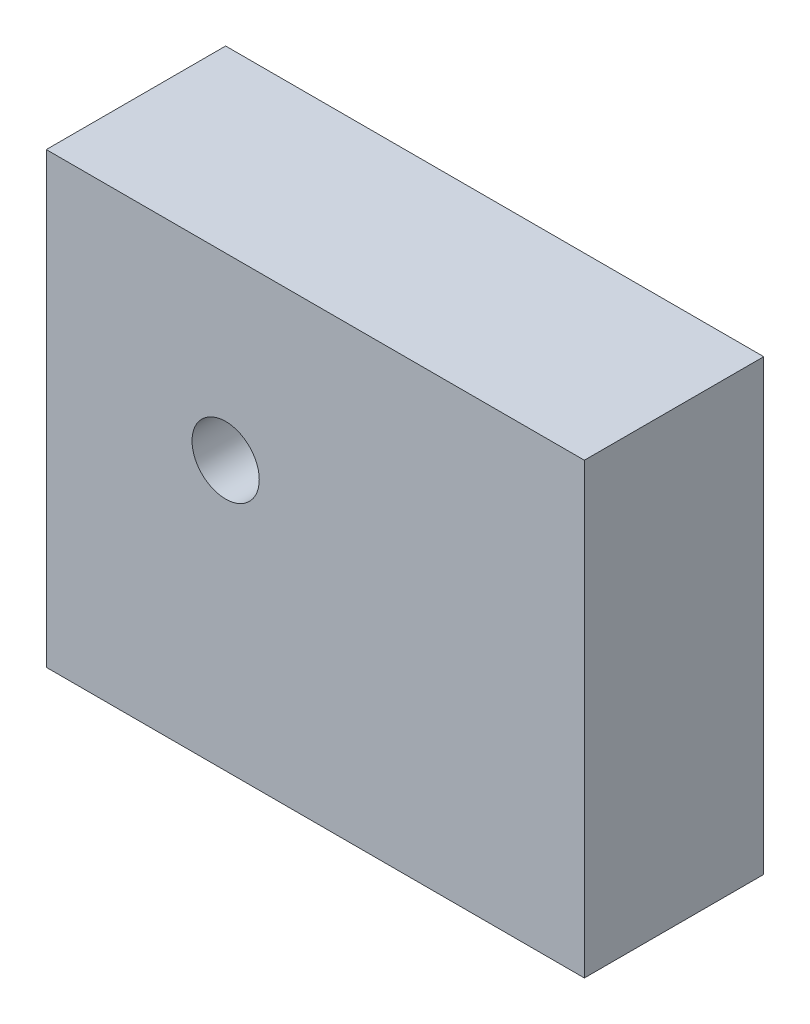
ISO-10303-21;
HEADER;
FILE_DESCRIPTION(('STEP AP214'),'2;1');
FILE_NAME('part.step','',(''),(''),'','','');
FILE_SCHEMA(('AUTOMOTIVE_DESIGN { 1 0 10303 214 1 1 1 1 }'));
ENDSEC;
DATA;
#1=APPLICATION_CONTEXT('core data for automotive mechanical design processes');
#2=APPLICATION_PROTOCOL_DEFINITION('international standard','automotive_design',2000,#1);
#3=PRODUCT_CONTEXT('',#1,'mechanical');
#4=PRODUCT('Part','Part','',(#3));
#5=PRODUCT_RELATED_PRODUCT_CATEGORY('part','',(#4));
#6=PRODUCT_DEFINITION_FORMATION('','',#4);
#7=PRODUCT_DEFINITION_CONTEXT('part definition',#1,'design');
#8=PRODUCT_DEFINITION('design','',#6,#7);
#9=PRODUCT_DEFINITION_SHAPE('','',#8);
#10=(LENGTH_UNIT() NAMED_UNIT(*) SI_UNIT(.MILLI.,.METRE.));
#11=(NAMED_UNIT(*) PLANE_ANGLE_UNIT() SI_UNIT($,.RADIAN.));
#12=(NAMED_UNIT(*) SI_UNIT($,.STERADIAN.) SOLID_ANGLE_UNIT());
#13=UNCERTAINTY_MEASURE_WITH_UNIT(LENGTH_MEASURE(1.E-05),#10,'distance_accuracy_value','');
#14=(GEOMETRIC_REPRESENTATION_CONTEXT(3) GLOBAL_UNCERTAINTY_ASSIGNED_CONTEXT((#13)) GLOBAL_UNIT_ASSIGNED_CONTEXT((#10,
#11,#12)) REPRESENTATION_CONTEXT('',''));
#15=CARTESIAN_POINT('',(0.,0.,0.));
#16=DIRECTION('',(0.,0.,1.));
#17=DIRECTION('',(1.,0.,0.));
#18=AXIS2_PLACEMENT_3D('',#15,#16,#17);
#19=CARTESIAN_POINT('',(0.,0.,25.4));
#20=DIRECTION('',(0.,0.,-1.));
#21=DIRECTION('',(-1.,0.,0.));
#22=AXIS2_PLACEMENT_3D('',#19,#20,#21);
#23=PLANE('',#22);
#24=DIRECTION('',(0.,-1.,0.));
#25=VECTOR('',#24,1.);
#26=CARTESIAN_POINT('',(0.,0.,25.4));
#27=LINE('',#26,#25);
#28=CARTESIAN_POINT('',(0.,63.5,25.4));
#29=VERTEX_POINT('',#28);
#30=CARTESIAN_POINT('',(0.,0.,25.4));
#31=VERTEX_POINT('',#30);
#32=EDGE_CURVE('E85',#29,#31,#27,.T.);
#33=ORIENTED_EDGE('',*,*,#32,.T.);
#34=DIRECTION('',(1.,0.,0.));
#35=VECTOR('',#34,1.);
#36=CARTESIAN_POINT('',(0.,0.,25.4));
#37=LINE('',#36,#35);
#38=CARTESIAN_POINT('',(76.2,0.,25.4));
#39=VERTEX_POINT('',#38);
#40=EDGE_CURVE('E80',#31,#39,#37,.T.);
#41=ORIENTED_EDGE('',*,*,#40,.T.);
#42=DIRECTION('',(0.,1.,0.));
#43=VECTOR('',#42,1.);
#44=CARTESIAN_POINT('',(76.2,0.,25.4));
#45=LINE('',#44,#43);
#46=CARTESIAN_POINT('',(76.2,63.5,25.4));
#47=VERTEX_POINT('',#46);
#48=EDGE_CURVE('E83',#39,#47,#45,.T.);
#49=ORIENTED_EDGE('',*,*,#48,.T.);
#50=DIRECTION('',(-1.,0.,0.));
#51=VECTOR('',#50,1.);
#52=CARTESIAN_POINT('',(0.,63.5,25.4));
#53=LINE('',#52,#51);
#54=EDGE_CURVE('E50',#47,#29,#53,.T.);
#55=ORIENTED_EDGE('',*,*,#54,.T.);
#56=EDGE_LOOP('',(#33,#41,#49,#55));
#57=FACE_BOUND('',#56,.T.);
#58=CARTESIAN_POINT('',(25.4,38.1,25.4));
#59=DIRECTION('',(0.,0.,1.));
#60=DIRECTION('',(1.,0.,0.));
#61=AXIS2_PLACEMENT_3D('',#58,#59,#60);
#62=CIRCLE('',#61,4.7625);
#63=CARTESIAN_POINT('',(30.1625,38.1,25.4));
#64=VERTEX_POINT('',#63);
#65=EDGE_CURVE('E100',#64,#64,#62,.T.);
#66=ORIENTED_EDGE('',*,*,#65,.F.);
#67=EDGE_LOOP('',(#66));
#68=FACE_BOUND('',#67,.T.);
#69=ADVANCED_FACE('F33',(#57,#68),#23,.F.);
#70=CARTESIAN_POINT('',(0.,0.,0.));
#71=DIRECTION('',(0.,0.,-1.));
#72=DIRECTION('',(-1.,0.,0.));
#73=AXIS2_PLACEMENT_3D('',#70,#71,#72);
#74=PLANE('',#73);
#75=DIRECTION('',(0.,-1.,0.));
#76=VECTOR('',#75,1.);
#77=CARTESIAN_POINT('',(0.,0.,0.));
#78=LINE('',#77,#76);
#79=CARTESIAN_POINT('',(0.,63.5,0.));
#80=VERTEX_POINT('',#79);
#81=CARTESIAN_POINT('',(0.,0.,0.));
#82=VERTEX_POINT('',#81);
#83=EDGE_CURVE('E97',#80,#82,#78,.T.);
#84=ORIENTED_EDGE('',*,*,#83,.F.);
#85=DIRECTION('',(-1.,0.,0.));
#86=VECTOR('',#85,1.);
#87=CARTESIAN_POINT('',(0.,63.5,0.));
#88=LINE('',#87,#86);
#89=CARTESIAN_POINT('',(76.2,63.5,0.));
#90=VERTEX_POINT('',#89);
#91=EDGE_CURVE('E73',#90,#80,#88,.T.);
#92=ORIENTED_EDGE('',*,*,#91,.F.);
#93=DIRECTION('',(0.,1.,0.));
#94=VECTOR('',#93,1.);
#95=CARTESIAN_POINT('',(76.2,0.,0.));
#96=LINE('',#95,#94);
#97=CARTESIAN_POINT('',(76.2,0.,0.));
#98=VERTEX_POINT('',#97);
#99=EDGE_CURVE('E67',#98,#90,#96,.T.);
#100=ORIENTED_EDGE('',*,*,#99,.F.);
#101=DIRECTION('',(1.,0.,0.));
#102=VECTOR('',#101,1.);
#103=CARTESIAN_POINT('',(0.,0.,0.));
#104=LINE('',#103,#102);
#105=EDGE_CURVE('E89',#82,#98,#104,.T.);
#106=ORIENTED_EDGE('',*,*,#105,.F.);
#107=EDGE_LOOP('',(#84,#92,#100,#106));
#108=FACE_BOUND('',#107,.T.);
#109=CARTESIAN_POINT('',(25.4,38.1,0.));
#110=DIRECTION('',(0.,0.,1.));
#111=DIRECTION('',(1.,0.,0.));
#112=AXIS2_PLACEMENT_3D('',#109,#110,#111);
#113=CIRCLE('',#112,4.7625);
#114=CARTESIAN_POINT('',(30.1625,38.1,0.));
#115=VERTEX_POINT('',#114);
#116=EDGE_CURVE('E112',#115,#115,#113,.T.);
#117=ORIENTED_EDGE('',*,*,#116,.T.);
#118=EDGE_LOOP('',(#117));
#119=FACE_BOUND('',#118,.T.);
#120=ADVANCED_FACE('F108',(#108,#119),#74,.T.);
#121=CARTESIAN_POINT('',(0.,0.,25.4));
#122=DIRECTION('',(1.,0.,0.));
#123=DIRECTION('',(0.,0.,-1.));
#124=AXIS2_PLACEMENT_3D('',#121,#122,#123);
#125=PLANE('',#124);
#126=ORIENTED_EDGE('',*,*,#83,.T.);
#127=DIRECTION('',(0.,0.,-1.));
#128=VECTOR('',#127,1.);
#129=CARTESIAN_POINT('',(0.,0.,25.4));
#130=LINE('',#129,#128);
#131=EDGE_CURVE('E11',#31,#82,#130,.T.);
#132=ORIENTED_EDGE('',*,*,#131,.F.);
#133=ORIENTED_EDGE('',*,*,#32,.F.);
#134=DIRECTION('',(0.,0.,-1.));
#135=VECTOR('',#134,1.);
#136=CARTESIAN_POINT('',(0.,63.5,25.4));
#137=LINE('',#136,#135);
#138=EDGE_CURVE('E93',#29,#80,#137,.T.);
#139=ORIENTED_EDGE('',*,*,#138,.T.);
#140=EDGE_LOOP('',(#126,#132,#133,#139));
#141=FACE_BOUND('',#140,.T.);
#142=ADVANCED_FACE('F35',(#141),#125,.F.);
#143=CARTESIAN_POINT('',(0.,0.,25.4));
#144=DIRECTION('',(0.,1.,0.));
#145=DIRECTION('',(0.,0.,1.));
#146=AXIS2_PLACEMENT_3D('',#143,#144,#145);
#147=PLANE('',#146);
#148=ORIENTED_EDGE('',*,*,#105,.T.);
#149=DIRECTION('',(0.,0.,-1.));
#150=VECTOR('',#149,1.);
#151=CARTESIAN_POINT('',(76.2,0.,25.4));
#152=LINE('',#151,#150);
#153=EDGE_CURVE('E42',#39,#98,#152,.T.);
#154=ORIENTED_EDGE('',*,*,#153,.F.);
#155=ORIENTED_EDGE('',*,*,#40,.F.);
#156=ORIENTED_EDGE('',*,*,#131,.T.);
#157=EDGE_LOOP('',(#148,#154,#155,#156));
#158=FACE_BOUND('',#157,.T.);
#159=ADVANCED_FACE('F88',(#158),#147,.F.);
#160=CARTESIAN_POINT('',(76.2,0.,25.4));
#161=DIRECTION('',(-1.,0.,0.));
#162=DIRECTION('',(0.,0.,1.));
#163=AXIS2_PLACEMENT_3D('',#160,#161,#162);
#164=PLANE('',#163);
#165=ORIENTED_EDGE('',*,*,#99,.T.);
#166=DIRECTION('',(0.,0.,-1.));
#167=VECTOR('',#166,1.);
#168=CARTESIAN_POINT('',(76.2,63.5,25.4));
#169=LINE('',#168,#167);
#170=EDGE_CURVE('E90',#47,#90,#169,.T.);
#171=ORIENTED_EDGE('',*,*,#170,.F.);
#172=ORIENTED_EDGE('',*,*,#48,.F.);
#173=ORIENTED_EDGE('',*,*,#153,.T.);
#174=EDGE_LOOP('',(#165,#171,#172,#173));
#175=FACE_BOUND('',#174,.T.);
#176=ADVANCED_FACE('F91',(#175),#164,.F.);
#177=CARTESIAN_POINT('',(0.,63.5,25.4));
#178=DIRECTION('',(0.,-1.,0.));
#179=DIRECTION('',(0.,0.,-1.));
#180=AXIS2_PLACEMENT_3D('',#177,#178,#179);
#181=PLANE('',#180);
#182=ORIENTED_EDGE('',*,*,#91,.T.);
#183=ORIENTED_EDGE('',*,*,#138,.F.);
#184=ORIENTED_EDGE('',*,*,#54,.F.);
#185=ORIENTED_EDGE('',*,*,#170,.T.);
#186=EDGE_LOOP('',(#182,#183,#184,#185));
#187=FACE_BOUND('',#186,.T.);
#188=ADVANCED_FACE('F105',(#187),#181,.F.);
#189=CARTESIAN_POINT('',(25.4,38.1,25.4));
#190=DIRECTION('',(0.,0.,-1.));
#191=DIRECTION('',(-1.,0.,0.));
#192=AXIS2_PLACEMENT_3D('',#189,#190,#191);
#193=CYLINDRICAL_SURFACE('',#192,4.7625);
#194=ORIENTED_EDGE('',*,*,#65,.T.);
#195=EDGE_LOOP('',(#194));
#196=FACE_BOUND('',#195,.T.);
#197=ORIENTED_EDGE('',*,*,#116,.F.);
#198=EDGE_LOOP('',(#197));
#199=FACE_BOUND('',#198,.T.);
#200=ADVANCED_FACE('F118',(#196,#199),#193,.F.);
#201=CLOSED_SHELL('',(#69,#120,#142,#159,#176,#188,#200));
#202=MANIFOLD_SOLID_BREP('B2',#201);
#203=ADVANCED_BREP_SHAPE_REPRESENTATION('',(#18,#202),#14);
#204=SHAPE_DEFINITION_REPRESENTATION(#9,#203);
ENDSEC;
END-ISO-10303-21;
